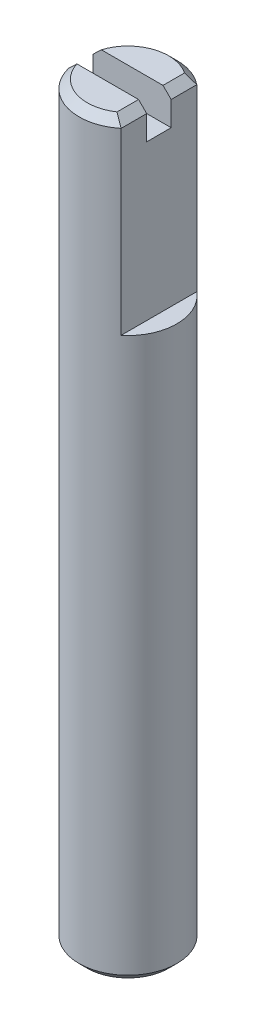
ISO-10303-21;
HEADER;
FILE_DESCRIPTION(('STEP AP214'),'2;1');
FILE_NAME('part.step','',(''),(''),'','','');
FILE_SCHEMA(('AUTOMOTIVE_DESIGN { 1 0 10303 214 1 1 1 1 }'));
ENDSEC;
DATA;
#1=APPLICATION_CONTEXT('core data for automotive mechanical design processes');
#2=APPLICATION_PROTOCOL_DEFINITION('international standard','automotive_design',2000,#1);
#3=PRODUCT_CONTEXT('',#1,'mechanical');
#4=PRODUCT('Part','Part','',(#3));
#5=PRODUCT_RELATED_PRODUCT_CATEGORY('part','',(#4));
#6=PRODUCT_DEFINITION_FORMATION('','',#4);
#7=PRODUCT_DEFINITION_CONTEXT('part definition',#1,'design');
#8=PRODUCT_DEFINITION('design','',#6,#7);
#9=PRODUCT_DEFINITION_SHAPE('','',#8);
#10=(LENGTH_UNIT() NAMED_UNIT(*) SI_UNIT(.MILLI.,.METRE.));
#11=(NAMED_UNIT(*) PLANE_ANGLE_UNIT() SI_UNIT($,.RADIAN.));
#12=(NAMED_UNIT(*) SI_UNIT($,.STERADIAN.) SOLID_ANGLE_UNIT());
#13=UNCERTAINTY_MEASURE_WITH_UNIT(LENGTH_MEASURE(1.E-05),#10,'distance_accuracy_value','');
#14=(GEOMETRIC_REPRESENTATION_CONTEXT(3) GLOBAL_UNCERTAINTY_ASSIGNED_CONTEXT((#13)) GLOBAL_UNIT_ASSIGNED_CONTEXT((#10,
#11,#12)) REPRESENTATION_CONTEXT('',''));
#15=CARTESIAN_POINT('',(0.,0.,0.));
#16=DIRECTION('',(0.,0.,1.));
#17=DIRECTION('',(1.,0.,0.));
#18=AXIS2_PLACEMENT_3D('',#15,#16,#17);
#19=CARTESIAN_POINT('',(0.,46.,0.));
#20=DIRECTION('',(0.,1.,0.));
#21=DIRECTION('',(0.,0.,1.));
#22=AXIS2_PLACEMENT_3D('',#19,#20,#21);
#23=PLANE('',#22);
#24=DIRECTION('',(-1.,0.,0.));
#25=VECTOR('',#24,1.);
#26=CARTESIAN_POINT('',(-4.20448110963809,46.,-0.75));
#27=LINE('',#26,#25);
#28=CARTESIAN_POINT('',(1.4,46.,-0.75));
#29=VERTEX_POINT('',#28);
#30=CARTESIAN_POINT('',(-2.38484800354237,46.,-0.75));
#31=VERTEX_POINT('',#30);
#32=EDGE_CURVE('E117',#29,#31,#27,.T.);
#33=ORIENTED_EDGE('',*,*,#32,.F.);
#34=DIRECTION('',(0.,0.,-1.));
#35=VECTOR('',#34,1.);
#36=CARTESIAN_POINT('',(1.4,46.,-2.32163735324878));
#37=LINE('',#36,#35);
#38=CARTESIAN_POINT('',(1.4,46.,-2.0712315177208));
#39=VERTEX_POINT('',#38);
#40=EDGE_CURVE('E127',#29,#39,#37,.T.);
#41=ORIENTED_EDGE('',*,*,#40,.T.);
#42=CARTESIAN_POINT('',(0.,46.,0.));
#43=DIRECTION('',(0.,1.,0.));
#44=DIRECTION('',(0.,0.,1.));
#45=AXIS2_PLACEMENT_3D('',#42,#43,#44);
#46=CIRCLE('',#45,2.5);
#47=EDGE_CURVE('E123',#39,#31,#46,.T.);
#48=ORIENTED_EDGE('',*,*,#47,.T.);
#49=EDGE_LOOP('',(#33,#41,#48));
#50=FACE_BOUND('',#49,.T.);
#51=ADVANCED_FACE('F36',(#50),#23,.T.);
#52=CARTESIAN_POINT('',(0.,46.,0.));
#53=DIRECTION('',(0.,-1.,0.));
#54=DIRECTION('',(0.,0.,-1.));
#55=AXIS2_PLACEMENT_3D('',#52,#53,#54);
#56=CONICAL_SURFACE('',#55,2.5,0.785398163397446);
#57=CARTESIAN_POINT('',(4.85546648544594,43.5869505608748,-0.75));
#58=CARTESIAN_POINT('',(4.71391751814024,43.7268339179038,-0.75));
#59=CARTESIAN_POINT('',(4.57230358961933,43.8666516445853,-0.75));
#60=CARTESIAN_POINT('',(4.28880108237509,44.1461810613772,-0.75));
#61=CARTESIAN_POINT('',(4.14691238893823,44.2858926351272,-0.75));
#62=CARTESIAN_POINT('',(3.86127263974073,44.5666520980558,-0.75));
#63=CARTESIAN_POINT('',(3.71751875661088,44.7076971132396,-0.75));
#64=CARTESIAN_POINT('',(3.42974051573235,44.9893367037925,-0.75));
#65=CARTESIAN_POINT('',(3.28571637369892,45.1299314997118,-0.75));
#66=CARTESIAN_POINT('',(2.93989103598639,45.4663218282814,-0.75));
#67=CARTESIAN_POINT('',(2.73785155133891,45.6618733471203,-0.75));
#68=CARTESIAN_POINT('',(2.43320769576117,45.9539852679423,-0.75));
#69=CARTESIAN_POINT('',(2.33128569885287,46.0512568065885,-0.75));
#70=CARTESIAN_POINT('',(2.12679744855882,46.2450738434784,-0.75));
#71=CARTESIAN_POINT('',(2.02423135234748,46.3416195071128,-0.75));
#72=CARTESIAN_POINT('',(1.81902178806528,46.5327781653922,-0.75));
#73=CARTESIAN_POINT('',(1.7163872378001,46.6274007248914,-0.75));
#74=CARTESIAN_POINT('',(1.50947924967405,46.8150418941384,-0.75));
#75=CARTESIAN_POINT('',(1.40520442567092,46.9080589906662,-0.75));
#76=CARTESIAN_POINT('',(1.24697987681958,47.0450828543339,-0.75));
#77=CARTESIAN_POINT('',(1.19404151140738,47.090254667941,-0.75));
#78=CARTESIAN_POINT('',(1.08724510724501,47.1794946775113,-0.75));
#79=CARTESIAN_POINT('',(1.03338715456041,47.2235629758124,-0.75));
#80=CARTESIAN_POINT('',(0.92446536873339,47.3100253586608,-0.75));
#81=CARTESIAN_POINT('',(0.869403377208695,47.3524217552695,-0.75));
#82=CARTESIAN_POINT('',(0.757461961467523,47.4347314734575,-0.75));
#83=CARTESIAN_POINT('',(0.700583630230699,47.4746462472666,-0.75));
#84=CARTESIAN_POINT('',(0.627950659447265,47.5218870208621,-0.75));
#85=CARTESIAN_POINT('',(0.613448673839788,47.5311399395592,-0.75));
#86=CARTESIAN_POINT('',(0.584259867977792,47.5493534183932,-0.75));
#87=CARTESIAN_POINT('',(0.56957302486066,47.5583139418653,-0.75));
#88=CARTESIAN_POINT('',(0.525209815191698,47.584697350443,-0.75));
#89=CARTESIAN_POINT('',(0.495232542840808,47.601620906839,-0.75));
#90=CARTESIAN_POINT('',(0.434575158801095,47.6335724992165,-0.75));
#91=CARTESIAN_POINT('',(0.403902488412216,47.6486144784893,-0.75));
#92=CARTESIAN_POINT('',(0.341525886813764,47.6763740420576,-0.75));
#93=CARTESIAN_POINT('',(0.309822292485401,47.6890923768492,-0.75));
#94=CARTESIAN_POINT('',(0.233817168557133,47.7154671874918,-0.75));
#95=CARTESIAN_POINT('',(0.189048524095931,47.7278459632544,-0.75));
#96=CARTESIAN_POINT('',(0.0981565745366103,47.7449059854211,-0.75));
#97=CARTESIAN_POINT('',(0.0520389613173522,47.7496158440244,-0.75));
#98=CARTESIAN_POINT('',(-0.0404571223636343,47.750339451112,-0.75));
#99=CARTESIAN_POINT('',(-0.0868358956972547,47.7463181258543,-0.75));
#100=CARTESIAN_POINT('',(-0.178298341126961,47.7304300811928,-0.75));
#101=CARTESIAN_POINT('',(-0.223377161429271,47.7185371603029,-0.75));
#102=CARTESIAN_POINT('',(-0.314423603805141,47.6879695597888,-0.75));
#103=CARTESIAN_POINT('',(-0.360251724417719,47.6688972445175,-0.75));
#104=CARTESIAN_POINT('',(-0.449840775637533,47.6263300876817,-0.75));
#105=CARTESIAN_POINT('',(-0.493597612467751,47.6028269108554,-0.75));
#106=CARTESIAN_POINT('',(-0.579732918556699,47.5527115468484,-0.75));
#107=CARTESIAN_POINT('',(-0.622097496569792,47.5260759078861,-0.75));
#108=CARTESIAN_POINT('',(-0.705449000112637,47.4708315616801,-0.75));
#109=CARTESIAN_POINT('',(-0.74643712127383,47.4422246363411,-0.75));
#110=CARTESIAN_POINT('',(-0.831072229251538,47.3809590503304,-0.75));
#111=CARTESIAN_POINT('',(-0.874622926775298,47.3481682938371,-0.75));
#112=CARTESIAN_POINT('',(-0.960822536400224,47.2814182298283,-0.75));
#113=CARTESIAN_POINT('',(-1.00347132752926,47.24745876714,-0.75));
#114=CARTESIAN_POINT('',(-1.13043861769896,47.1442974143724,-0.75));
#115=CARTESIAN_POINT('',(-1.21373668759201,47.0738435287605,-0.75));
#116=CARTESIAN_POINT('',(-1.37882945788233,46.9309270443904,-0.75));
#117=CARTESIAN_POINT('',(-1.46062122307301,46.8584610979528,-0.75));
#118=CARTESIAN_POINT('',(-1.62310045342943,46.7123495844164,-0.75));
#119=CARTESIAN_POINT('',(-1.70378822539481,46.6387043579155,-0.75));
#120=CARTESIAN_POINT('',(-1.86416074739795,46.490861579326,-0.75));
#121=CARTESIAN_POINT('',(-1.94384793209381,46.4166666593713,-0.75));
#122=CARTESIAN_POINT('',(-2.1027035826176,46.2677129725153,-0.75));
#123=CARTESIAN_POINT('',(-2.18187201115016,46.1929541658874,-0.75));
#124=CARTESIAN_POINT('',(-2.41864694962691,45.968230811901,-0.75));
#125=CARTESIAN_POINT('',(-2.57568545292842,45.8176683462495,-0.75));
#126=CARTESIAN_POINT('',(-2.86586604270801,45.5378268042253,-0.75));
#127=CARTESIAN_POINT('',(-2.99912819937921,45.4086718083781,-0.75));
#128=CARTESIAN_POINT('',(-3.26521025306288,45.1499047273037,-0.75));
#129=CARTESIAN_POINT('',(-3.39803014618622,45.0202926380775,-0.75));
#130=CARTESIAN_POINT('',(-3.79613359583078,44.6308842912431,-0.75));
#131=CARTESIAN_POINT('',(-4.06095635023667,44.3706172796803,-0.75));
#132=CARTESIAN_POINT('',(-4.58978064471943,43.8495620771406,-0.75));
#133=CARTESIAN_POINT('',(-4.8537825762484,43.5887742828285,-0.75));
#134=CARTESIAN_POINT('',(-5.38124093951394,43.0668694648215,-0.75));
#135=CARTESIAN_POINT('',(-5.64469755416627,42.8057526260434,-0.75));
#136=CARTESIAN_POINT('',(-5.90805222211768,42.5445335145541,-0.75));
#137=B_SPLINE_CURVE_WITH_KNOTS('',3,(#57,#58,#59,#60,#61,#62,#63,#64,#65,#66,#67,#68,#69,#70,
#71,#72,#73,#74,#75,#76,#77,#78,#79,#80,#81,#82,#83,#84,#85,#86,#87,#88,#89,#90,#91,#92,#93,#94,
#95,#96,#97,#98,#99,#100,#101,#102,#103,#104,#105,#106,#107,#108,#109,#110,#111,#112,#113,#114,
#115,#116,#117,#118,#119,#120,#121,#122,#123,#124,#125,#126,#127,#128,#129,#130,#131,#132,#133,
#134,#135,#136),.UNSPECIFIED.,.F.,.F.,(4,2,2,2,2,2,2,2,2,2,2,2,2,2,2,2,2,2,2,2,2,2,2,2,2,2,2,2,
2,2,2,2,2,2,2,2,2,2,2,4),(0.,0.597018640220917,1.19440070987918,1.79857709732601,
2.40238869166986,3.24591029076411,3.66857683630106,4.09114396635307,4.50992701708793,
4.92908532496539,5.13785016972322,5.34659558181231,5.55504140225114,5.7633640705378,
5.81496833806888,5.86657905182656,5.96980684555416,6.0722175620409,6.17459514297382,
6.31341671385353,6.45171915432519,6.59057819238501,6.72990177852883,6.87847008513261,
7.0273207163603,7.17736672356993,7.32727883518822,7.49079613313603,7.6543352262002,
7.98156825423644,8.30938290016302,8.63710451631824,8.96374229694019,9.29040330867593,
9.94306027188856,10.4997984074273,11.0565414258687,12.1704642859962,13.2837318558053,
14.3965305597468),.UNSPECIFIED.);
#138=CARTESIAN_POINT('',(-2.90473750965556,45.5,-0.75));
#139=VERTEX_POINT('',#138);
#140=EDGE_CURVE('E205',#31,#139,#137,.T.);
#141=ORIENTED_EDGE('',*,*,#140,.F.);
#142=ORIENTED_EDGE('',*,*,#47,.F.);
#143=CARTESIAN_POINT('',(1.4,46.,-2.0712315177208));
#144=CARTESIAN_POINT('',(1.4413852135024,45.9586147864976,-2.09320945461325));
#145=CARTESIAN_POINT('',(1.48285098512596,45.917149014874,-2.11488261625374));
#146=CARTESIAN_POINT('',(1.56592540981716,45.8340745901828,-2.15765950140076));
#147=CARTESIAN_POINT('',(1.60753405112698,45.792465948873,-2.17876327055802));
#148=CARTESIAN_POINT('',(1.69088190476341,45.7091180952366,-2.22044463609142));
#149=CARTESIAN_POINT('',(1.73262111476999,45.66737888523,-2.24102224175779));
#150=CARTESIAN_POINT('',(1.81622229209506,45.5837777079049,-2.28168833918956));
#151=CARTESIAN_POINT('',(1.85808426901179,45.5419157309882,-2.30177679150407));
#152=CARTESIAN_POINT('',(1.9,45.5,-2.32163735324878));
#153=B_SPLINE_CURVE_WITH_KNOTS('',3,(#143,#144,#145,#146,#147,#148,#149,#150,#151,#152),
.UNSPECIFIED.,.F.,.F.,(4,2,2,2,4),(0.,0.187552478291846,0.375089874712568,0.562623957579342,
0.750173115565102),.UNSPECIFIED.);
#154=CARTESIAN_POINT('',(1.9,45.5,-2.32163735324878));
#155=VERTEX_POINT('',#154);
#156=EDGE_CURVE('E149',#155,#39,#153,.F.);
#157=ORIENTED_EDGE('',*,*,#156,.F.);
#158=CARTESIAN_POINT('',(0.,45.5,0.));
#159=DIRECTION('',(0.,1.,0.));
#160=DIRECTION('',(0.,0.,1.));
#161=AXIS2_PLACEMENT_3D('',#158,#159,#160);
#162=CIRCLE('',#161,3.);
#163=EDGE_CURVE('E137',#139,#155,#162,.F.);
#164=ORIENTED_EDGE('',*,*,#163,.F.);
#165=EDGE_LOOP('',(#141,#142,#157,#164));
#166=FACE_BOUND('',#165,.T.);
#167=ADVANCED_FACE('F170',(#166),#56,.T.);
#168=CARTESIAN_POINT('',(1.9,45.5,-3.80448227912211));
#169=DIRECTION('',(0.707106781186549,0.707106781186546,0.));
#170=DIRECTION('',(-0.707106781186546,0.707106781186549,0.));
#171=AXIS2_PLACEMENT_3D('',#168,#169,#170);
#172=PLANE('',#171);
#173=DIRECTION('',(-0.707106781186546,0.707106781186549,0.));
#174=VECTOR('',#173,1.);
#175=CARTESIAN_POINT('',(1.9,45.5,-0.75));
#176=LINE('',#175,#174);
#177=CARTESIAN_POINT('',(1.9,45.5,-0.75));
#178=VERTEX_POINT('',#177);
#179=EDGE_CURVE('E44',#178,#29,#176,.T.);
#180=ORIENTED_EDGE('',*,*,#179,.F.);
#181=DIRECTION('',(0.,0.,1.));
#182=VECTOR('',#181,1.);
#183=CARTESIAN_POINT('',(1.9,45.5,2.32163735324878));
#184=LINE('',#183,#182);
#185=EDGE_CURVE('E124',#155,#178,#184,.T.);
#186=ORIENTED_EDGE('',*,*,#185,.F.);
#187=ORIENTED_EDGE('',*,*,#156,.T.);
#188=ORIENTED_EDGE('',*,*,#40,.F.);
#189=EDGE_LOOP('',(#180,#186,#187,#188));
#190=FACE_BOUND('',#189,.T.);
#191=ADVANCED_FACE('F161',(#190),#172,.T.);
#192=CARTESIAN_POINT('',(0.,46.,0.));
#193=DIRECTION('',(0.,-1.,0.));
#194=DIRECTION('',(0.,0.,-1.));
#195=AXIS2_PLACEMENT_3D('',#192,#193,#194);
#196=CYLINDRICAL_SURFACE('',#195,3.);
#197=CARTESIAN_POINT('',(0.,0.499999999999987,0.));
#198=DIRECTION('',(0.,1.,0.));
#199=DIRECTION('',(0.,0.,1.));
#200=AXIS2_PLACEMENT_3D('',#197,#198,#199);
#201=CIRCLE('',#200,3.);
#202=CARTESIAN_POINT('',(0.,0.499999999999987,3.));
#203=VERTEX_POINT('',#202);
#204=EDGE_CURVE('E134',#203,#203,#201,.T.);
#205=ORIENTED_EDGE('',*,*,#204,.T.);
#206=EDGE_LOOP('',(#205));
#207=FACE_BOUND('',#206,.T.);
#208=CARTESIAN_POINT('',(0.,44.,0.));
#209=DIRECTION('',(0.,1.,0.));
#210=DIRECTION('',(0.,0.,1.));
#211=AXIS2_PLACEMENT_3D('',#208,#209,#210);
#212=CIRCLE('',#211,3.);
#213=CARTESIAN_POINT('',(-2.90473750965556,44.,-0.75));
#214=VERTEX_POINT('',#213);
#215=CARTESIAN_POINT('',(-2.90473750965556,44.,0.75));
#216=VERTEX_POINT('',#215);
#217=EDGE_CURVE('E150',#214,#216,#212,.T.);
#218=ORIENTED_EDGE('',*,*,#217,.F.);
#219=DIRECTION('',(0.,-1.,0.));
#220=VECTOR('',#219,1.);
#221=CARTESIAN_POINT('',(-2.90473750965556,46.,-0.75));
#222=LINE('',#221,#220);
#223=EDGE_CURVE('E199',#214,#139,#222,.F.);
#224=ORIENTED_EDGE('',*,*,#223,.T.);
#225=ORIENTED_EDGE('',*,*,#163,.T.);
#226=DIRECTION('',(0.,-1.,0.));
#227=VECTOR('',#226,1.);
#228=CARTESIAN_POINT('',(1.9,46.,-2.32163735324878));
#229=LINE('',#228,#227);
#230=CARTESIAN_POINT('',(1.9,34.5,-2.32163735324878));
#231=VERTEX_POINT('',#230);
#232=EDGE_CURVE('E215',#155,#231,#229,.T.);
#233=ORIENTED_EDGE('',*,*,#232,.T.);
#234=CARTESIAN_POINT('',(0.,34.5,0.));
#235=DIRECTION('',(0.,1.,0.));
#236=DIRECTION('',(0.,0.,1.));
#237=AXIS2_PLACEMENT_3D('',#234,#235,#236);
#238=CIRCLE('',#237,3.);
#239=CARTESIAN_POINT('',(1.9,34.5,2.32163735324878));
#240=VERTEX_POINT('',#239);
#241=EDGE_CURVE('E216',#240,#231,#238,.T.);
#242=ORIENTED_EDGE('',*,*,#241,.F.);
#243=DIRECTION('',(0.,-1.,0.));
#244=VECTOR('',#243,1.);
#245=CARTESIAN_POINT('',(1.9,46.,2.32163735324878));
#246=LINE('',#245,#244);
#247=CARTESIAN_POINT('',(1.9,45.5,2.32163735324878));
#248=VERTEX_POINT('',#247);
#249=EDGE_CURVE('E212',#240,#248,#246,.F.);
#250=ORIENTED_EDGE('',*,*,#249,.T.);
#251=CARTESIAN_POINT('',(-2.90473750965556,45.5,0.75));
#252=VERTEX_POINT('',#251);
#253=EDGE_CURVE('E138',#248,#252,#162,.F.);
#254=ORIENTED_EDGE('',*,*,#253,.T.);
#255=DIRECTION('',(0.,-1.,0.));
#256=VECTOR('',#255,1.);
#257=CARTESIAN_POINT('',(-2.90473750965556,46.,0.75));
#258=LINE('',#257,#256);
#259=EDGE_CURVE('E109',#252,#216,#258,.T.);
#260=ORIENTED_EDGE('',*,*,#259,.T.);
#261=EDGE_LOOP('',(#218,#224,#225,#233,#242,#250,#254,#260));
#262=FACE_BOUND('',#261,.T.);
#263=ADVANCED_FACE('F172',(#207,#262),#196,.T.);
#264=DIRECTION('',(1.,0.,0.));
#265=VECTOR('',#264,1.);
#266=CARTESIAN_POINT('',(0.750000000000001,46.,0.75));
#267=LINE('',#266,#265);
#268=CARTESIAN_POINT('',(-2.38484800354237,46.,0.75));
#269=VERTEX_POINT('',#268);
#270=CARTESIAN_POINT('',(1.4,46.,0.750000000000001));
#271=VERTEX_POINT('',#270);
#272=EDGE_CURVE('E51',#269,#271,#267,.T.);
#273=ORIENTED_EDGE('',*,*,#272,.F.);
#274=CARTESIAN_POINT('',(1.4,46.,2.0712315177208));
#275=VERTEX_POINT('',#274);
#276=EDGE_CURVE('E58',#269,#275,#46,.T.);
#277=ORIENTED_EDGE('',*,*,#276,.T.);
#278=EDGE_CURVE('E116',#275,#271,#37,.T.);
#279=ORIENTED_EDGE('',*,*,#278,.T.);
#280=EDGE_LOOP('',(#273,#277,#279));
#281=FACE_BOUND('',#280,.T.);
#282=ADVANCED_FACE('F115',(#281),#23,.T.);
#283=CARTESIAN_POINT('',(0.,0.,0.));
#284=DIRECTION('',(0.,1.,0.));
#285=DIRECTION('',(0.,0.,1.));
#286=AXIS2_PLACEMENT_3D('',#283,#284,#285);
#287=PLANE('',#286);
#288=CARTESIAN_POINT('',(0.,0.,0.));
#289=DIRECTION('',(0.,1.,0.));
#290=DIRECTION('',(0.,0.,1.));
#291=AXIS2_PLACEMENT_3D('',#288,#289,#290);
#292=CIRCLE('',#291,2.50000000000001);
#293=CARTESIAN_POINT('',(0.,0.,2.50000000000001));
#294=VERTEX_POINT('',#293);
#295=EDGE_CURVE('E140',#294,#294,#292,.F.);
#296=ORIENTED_EDGE('',*,*,#295,.T.);
#297=EDGE_LOOP('',(#296));
#298=FACE_BOUND('',#297,.T.);
#299=ADVANCED_FACE('F185',(#298),#287,.F.);
#300=CARTESIAN_POINT('',(1.9,34.5,4.94695527819999));
#301=DIRECTION('',(0.,1.,0.));
#302=DIRECTION('',(0.,0.,1.));
#303=AXIS2_PLACEMENT_3D('',#300,#301,#302);
#304=PLANE('',#303);
#305=ORIENTED_EDGE('',*,*,#241,.T.);
#306=DIRECTION('',(0.,0.,1.));
#307=VECTOR('',#306,1.);
#308=CARTESIAN_POINT('',(1.9,34.5,-3.80448227912211));
#309=LINE('',#308,#307);
#310=EDGE_CURVE('E209',#231,#240,#309,.T.);
#311=ORIENTED_EDGE('',*,*,#310,.T.);
#312=EDGE_LOOP('',(#305,#311));
#313=FACE_BOUND('',#312,.T.);
#314=ADVANCED_FACE('F190',(#313),#304,.T.);
#315=CARTESIAN_POINT('',(1.9,34.5,-3.80448227912211));
#316=DIRECTION('',(-1.,0.,0.));
#317=DIRECTION('',(0.,0.,1.));
#318=AXIS2_PLACEMENT_3D('',#315,#316,#317);
#319=PLANE('',#318);
#320=ORIENTED_EDGE('',*,*,#185,.T.);
#321=DIRECTION('',(0.,-1.,0.));
#322=VECTOR('',#321,1.);
#323=CARTESIAN_POINT('',(1.9,34.5,-0.75));
#324=LINE('',#323,#322);
#325=CARTESIAN_POINT('',(1.9,44.,-0.75));
#326=VERTEX_POINT('',#325);
#327=EDGE_CURVE('E240',#178,#326,#324,.T.);
#328=ORIENTED_EDGE('',*,*,#327,.T.);
#329=DIRECTION('',(0.,0.,-1.));
#330=VECTOR('',#329,1.);
#331=CARTESIAN_POINT('',(1.9,44.,-3.80448227912211));
#332=LINE('',#331,#330);
#333=CARTESIAN_POINT('',(1.9,44.,0.75));
#334=VERTEX_POINT('',#333);
#335=EDGE_CURVE('E11',#334,#326,#332,.T.);
#336=ORIENTED_EDGE('',*,*,#335,.F.);
#337=DIRECTION('',(0.,1.,0.));
#338=VECTOR('',#337,1.);
#339=CARTESIAN_POINT('',(1.9,34.5,0.75));
#340=LINE('',#339,#338);
#341=CARTESIAN_POINT('',(1.9,45.5,0.75));
#342=VERTEX_POINT('',#341);
#343=EDGE_CURVE('E113',#334,#342,#340,.T.);
#344=ORIENTED_EDGE('',*,*,#343,.T.);
#345=EDGE_CURVE('E129',#342,#248,#184,.T.);
#346=ORIENTED_EDGE('',*,*,#345,.T.);
#347=ORIENTED_EDGE('',*,*,#249,.F.);
#348=ORIENTED_EDGE('',*,*,#310,.F.);
#349=ORIENTED_EDGE('',*,*,#232,.F.);
#350=EDGE_LOOP('',(#320,#328,#336,#344,#346,#347,#348,#349));
#351=FACE_BOUND('',#350,.T.);
#352=ADVANCED_FACE('F169',(#351),#319,.F.);
#353=CARTESIAN_POINT('',(-5.90805222211768,42.5445335145541,0.75));
#354=CARTESIAN_POINT('',(-5.7300437395593,42.7211182797016,0.75));
#355=CARTESIAN_POINT('',(-5.5519781811539,42.8976455826347,0.75));
#356=CARTESIAN_POINT('',(-5.19562698595573,43.2505795944583,0.75));
#357=CARTESIAN_POINT('',(-5.01734130087648,43.4269862545898,0.75));
#358=CARTESIAN_POINT('',(-4.65953925429748,43.7805667968283,0.75));
#359=CARTESIAN_POINT('',(-4.4800216229419,43.9577393947003,0.75));
#360=CARTESIAN_POINT('',(-4.1207115762482,44.3117044062391,0.75));
#361=CARTESIAN_POINT('',(-3.94091925245865,44.4884969128669,0.75));
#362=CARTESIAN_POINT('',(-3.52463057261854,44.8967619641763,0.75));
#363=CARTESIAN_POINT('',(-3.28796588246162,45.1280633122341,0.75));
#364=CARTESIAN_POINT('',(-2.93173781752874,45.4739787964349,0.75));
#365=CARTESIAN_POINT('',(-2.81273196769819,45.5891667899296,0.75));
#366=CARTESIAN_POINT('',(-2.57419111944658,45.8189694466708,0.75));
#367=CARTESIAN_POINT('',(-2.45465617783918,45.9335841687885,0.75));
#368=CARTESIAN_POINT('',(-2.21530021118799,46.1614700985172,0.75));
#369=CARTESIAN_POINT('',(-2.0954826861627,46.2747449799585,0.75));
#370=CARTESIAN_POINT('',(-1.85454534965147,46.5000069277706,0.75));
#371=CARTESIAN_POINT('',(-1.7334250379864,46.6119934626787,0.75));
#372=CARTESIAN_POINT('',(-1.55021670981294,46.7780753151848,0.75));
#373=CARTESIAN_POINT('',(-1.48894715115251,46.8330720946584,0.75));
#374=CARTESIAN_POINT('',(-1.36565727342003,46.9422160700248,0.75));
#375=CARTESIAN_POINT('',(-1.30363698506068,46.9963633004663,0.75));
#376=CARTESIAN_POINT('',(-1.17858166104869,47.1033937084682,0.75));
#377=CARTESIAN_POINT('',(-1.11554730183056,47.1562776745826,0.75));
#378=CARTESIAN_POINT('',(-0.987957723082008,47.260171785908,0.75));
#379=CARTESIAN_POINT('',(-0.923402903655158,47.3111824152351,0.75));
#380=CARTESIAN_POINT('',(-0.837168345255993,47.3760904646723,0.75));
#381=CARTESIAN_POINT('',(-0.816538896509228,47.3913821651796,0.75));
#382=CARTESIAN_POINT('',(-0.775013631589498,47.4216017291049,0.75));
#383=CARTESIAN_POINT('',(-0.754117799148224,47.4365295701379,0.75));
#384=CARTESIAN_POINT('',(-0.690951805021064,47.4806851123899,0.75));
#385=CARTESIAN_POINT('',(-0.648224577913421,47.509268505437,0.75));
#386=CARTESIAN_POINT('',(-0.561600823562836,47.5636410896857,0.75));
#387=CARTESIAN_POINT('',(-0.517720246026501,47.5894553469718,0.75));
#388=CARTESIAN_POINT('',(-0.427969032507345,47.6373192838869,0.75));
#389=CARTESIAN_POINT('',(-0.382100935440808,47.6593735985522,0.75));
#390=CARTESIAN_POINT('',(-0.289139389490887,47.6972876205326,0.75));
#391=CARTESIAN_POINT('',(-0.242106331203806,47.7132899768874,0.75));
#392=CARTESIAN_POINT('',(-0.146147768547643,47.7372776002484,0.75));
#393=CARTESIAN_POINT('',(-0.0972336293325455,47.7453049543675,0.75));
#394=CARTESIAN_POINT('',(-0.0231864319626151,47.7500585271591,0.75));
#395=CARTESIAN_POINT('',(0.00174021004875388,47.7504109330291,0.75));
#396=CARTESIAN_POINT('',(0.0515048178641391,47.7486443534627,0.75));
#397=CARTESIAN_POINT('',(0.0763427829173864,47.7465253471521,0.75));
#398=CARTESIAN_POINT('',(0.150532486968317,47.736609846358,0.75));
#399=CARTESIAN_POINT('',(0.199425670405804,47.7252472831875,0.75));
#400=CARTESIAN_POINT('',(0.283280211488023,47.6990318217914,0.75));
#401=CARTESIAN_POINT('',(0.318752990991716,47.6856859693322,0.75));
#402=CARTESIAN_POINT('',(0.388429961633229,47.6559691533283,0.75));
#403=CARTESIAN_POINT('',(0.422633138445516,47.6395958309535,0.75));
#404=CARTESIAN_POINT('',(0.490028249367692,47.6045708122788,0.75));
#405=CARTESIAN_POINT('',(0.523214861788839,47.5859090683174,0.75));
#406=CARTESIAN_POINT('',(0.588599610908543,47.5469724534713,0.75));
#407=CARTESIAN_POINT('',(0.620798160111266,47.5266982688161,0.75));
#408=CARTESIAN_POINT('',(0.690544369206184,47.4809169359261,0.75));
#409=CARTESIAN_POINT('',(0.727923975932828,47.455155410087,0.75));
#410=CARTESIAN_POINT('',(0.801805936963717,47.4023988829232,0.75));
#411=CARTESIAN_POINT('',(0.838308117829014,47.3754036407425,0.75));
#412=CARTESIAN_POINT('',(0.946840298422189,47.2930352944314,0.75));
#413=CARTESIAN_POINT('',(1.01784429760509,47.2363148657792,0.75));
#414=CARTESIAN_POINT('',(1.15829144744998,47.1206628329758,0.75));
#415=CARTESIAN_POINT('',(1.22773037131685,47.061726175715,0.75));
#416=CARTESIAN_POINT('',(1.36541918193637,46.9425394229377,0.75));
#417=CARTESIAN_POINT('',(1.43366954370287,46.8822898748534,0.75));
#418=CARTESIAN_POINT('',(1.56956422312961,46.7607154767464,0.75));
#419=CARTESIAN_POINT('',(1.63720616737366,46.6993879848798,0.75));
#420=CARTESIAN_POINT('',(1.77191103420654,46.5760878717136,0.75));
#421=CARTESIAN_POINT('',(1.83897389770677,46.5141151859698,0.75));
#422=CARTESIAN_POINT('',(2.03932416042386,46.3276912815607,0.75));
#423=CARTESIAN_POINT('',(2.17197238810376,46.2025539425657,0.75));
#424=CARTESIAN_POINT('',(2.41240962976595,45.9739108837483,0.75));
#425=CARTESIAN_POINT('',(2.52036373335978,45.8705779549053,0.75));
#426=CARTESIAN_POINT('',(2.7357971345809,45.6634155440413,0.75));
#427=CARTESIAN_POINT('',(2.84327642614307,45.5595860557125,0.75));
#428=CARTESIAN_POINT('',(3.16533152506305,45.2474628467834,0.75));
#429=CARTESIAN_POINT('',(3.37940372913276,45.0386499826614,0.75));
#430=CARTESIAN_POINT('',(3.80412463678459,44.6228843071035,0.75));
#431=CARTESIAN_POINT('',(4.01478263102616,44.4159409665387,0.75));
#432=CARTESIAN_POINT('',(4.43548876894827,44.0016883458193,0.75));
#433=CARTESIAN_POINT('',(4.6455372036134,43.7943793612993,0.75));
#434=CARTESIAN_POINT('',(4.85546648544594,43.5869505608748,0.75));
#435=B_SPLINE_CURVE_WITH_KNOTS('',3,(#353,#354,#355,#356,#357,#358,#359,#360,#361,#362,#363,
#364,#365,#366,#367,#368,#369,#370,#371,#372,#373,#374,#375,#376,#377,#378,#379,#380,#381,#382,
#383,#384,#385,#386,#387,#388,#389,#390,#391,#392,#393,#394,#395,#396,#397,#398,#399,#400,#401,
#402,#403,#404,#405,#406,#407,#408,#409,#410,#411,#412,#413,#414,#415,#416,#417,#418,#419,#420,
#421,#422,#423,#424,#425,#426,#427,#428,#429,#430,#431,#432,#433,#434),.UNSPECIFIED.,.F.,.F.,(4,
2,2,2,2,2,2,2,2,2,2,2,2,2,2,2,2,2,2,2,2,2,2,2,2,2,2,2,2,2,2,2,2,2,2,2,2,2,2,2,4),(0.,
0.752211987196278,1.50463852943047,2.26130872152812,3.01776596840285,4.01053225491521,
4.50739736681278,5.00421036077185,5.49886459621984,5.99371605191733,6.24070792878019,
6.48768973501334,6.7345131133862,6.98127225115369,7.05830563449133,7.1353437450865,
7.2895007438732,7.4421173929317,7.59454452300597,7.74311397948915,7.89089514609984,
7.96556745017605,8.04024038496099,8.18998292366987,8.30353863450602,8.41718319710564,
8.53134591147411,8.64546029733427,8.78161595916709,8.91779831689761,9.19035042546889,
9.46356693171744,9.73667161676508,10.0105796952147,10.2845154002008,10.8315810074039,
11.2798944772936,11.7282136573395,12.6253536670476,13.5112542353314,14.3966209992728),.UNSPECIFIED.);
#436=EDGE_CURVE('E105',#252,#269,#435,.T.);
#437=ORIENTED_EDGE('',*,*,#436,.F.);
#438=ORIENTED_EDGE('',*,*,#253,.F.);
#439=CARTESIAN_POINT('',(1.9,45.5,2.32163735324878));
#440=CARTESIAN_POINT('',(1.85808426901179,45.5419157309882,2.30177679150407));
#441=CARTESIAN_POINT('',(1.81622229209505,45.5837777079049,2.28168833918956));
#442=CARTESIAN_POINT('',(1.73262111476999,45.66737888523,2.24102224175779));
#443=CARTESIAN_POINT('',(1.69088190476341,45.7091180952366,2.22044463609142));
#444=CARTESIAN_POINT('',(1.60753405112698,45.792465948873,2.17876327055802));
#445=CARTESIAN_POINT('',(1.56592540981716,45.8340745901828,2.15765950140076));
#446=CARTESIAN_POINT('',(1.48285098512596,45.917149014874,2.11488261625374));
#447=CARTESIAN_POINT('',(1.4413852135024,45.9586147864976,2.09320945461325));
#448=CARTESIAN_POINT('',(1.4,46.,2.0712315177208));
#449=B_SPLINE_CURVE_WITH_KNOTS('',3,(#439,#440,#441,#442,#443,#444,#445,#446,#447,#448),
.UNSPECIFIED.,.F.,.F.,(4,2,2,2,4),(0.,0.187549157985762,0.375083240852533,0.562620637273255,
0.750173115565101),.UNSPECIFIED.);
#450=EDGE_CURVE('E122',#275,#248,#449,.F.);
#451=ORIENTED_EDGE('',*,*,#450,.F.);
#452=ORIENTED_EDGE('',*,*,#276,.F.);
#453=EDGE_LOOP('',(#437,#438,#451,#452));
#454=FACE_BOUND('',#453,.T.);
#455=ADVANCED_FACE('F120',(#454),#56,.T.);
#456=DIRECTION('',(0.707106781186546,-0.707106781186549,0.));
#457=VECTOR('',#456,1.);
#458=CARTESIAN_POINT('',(1.9,45.5,0.75));
#459=LINE('',#458,#457);
#460=EDGE_CURVE('E143',#271,#342,#459,.T.);
#461=ORIENTED_EDGE('',*,*,#460,.F.);
#462=ORIENTED_EDGE('',*,*,#278,.F.);
#463=ORIENTED_EDGE('',*,*,#450,.T.);
#464=ORIENTED_EDGE('',*,*,#345,.F.);
#465=EDGE_LOOP('',(#461,#462,#463,#464));
#466=FACE_BOUND('',#465,.T.);
#467=ADVANCED_FACE('F157',(#466),#172,.T.);
#468=CARTESIAN_POINT('',(0.,0.499999999999987,0.));
#469=DIRECTION('',(0.,1.,0.));
#470=DIRECTION('',(0.,0.,1.));
#471=AXIS2_PLACEMENT_3D('',#468,#469,#470);
#472=CONICAL_SURFACE('',#471,3.,0.785398163397453);
#473=ORIENTED_EDGE('',*,*,#295,.F.);
#474=EDGE_LOOP('',(#473));
#475=FACE_BOUND('',#474,.T.);
#476=ORIENTED_EDGE('',*,*,#204,.F.);
#477=EDGE_LOOP('',(#476));
#478=FACE_BOUND('',#477,.T.);
#479=ADVANCED_FACE('F38',(#475,#478),#472,.T.);
#480=CARTESIAN_POINT('',(-4.20448110963809,44.,0.75));
#481=DIRECTION('',(0.,1.,0.));
#482=DIRECTION('',(0.,0.,1.));
#483=AXIS2_PLACEMENT_3D('',#480,#481,#482);
#484=PLANE('',#483);
#485=ORIENTED_EDGE('',*,*,#217,.T.);
#486=DIRECTION('',(1.,0.,0.));
#487=VECTOR('',#486,1.);
#488=CARTESIAN_POINT('',(-4.20448110963809,44.,0.75));
#489=LINE('',#488,#487);
#490=EDGE_CURVE('E235',#216,#334,#489,.T.);
#491=ORIENTED_EDGE('',*,*,#490,.T.);
#492=ORIENTED_EDGE('',*,*,#335,.T.);
#493=DIRECTION('',(-1.,0.,0.));
#494=VECTOR('',#493,1.);
#495=CARTESIAN_POINT('',(0.750000000000001,44.,-0.75));
#496=LINE('',#495,#494);
#497=EDGE_CURVE('E236',#326,#214,#496,.T.);
#498=ORIENTED_EDGE('',*,*,#497,.T.);
#499=EDGE_LOOP('',(#485,#491,#492,#498));
#500=FACE_BOUND('',#499,.T.);
#501=ADVANCED_FACE('F167',(#500),#484,.T.);
#502=CARTESIAN_POINT('',(-4.20448110963809,44.,-0.75));
#503=DIRECTION('',(0.,0.,-1.));
#504=DIRECTION('',(-1.,0.,0.));
#505=AXIS2_PLACEMENT_3D('',#502,#503,#504);
#506=PLANE('',#505);
#507=ORIENTED_EDGE('',*,*,#497,.F.);
#508=ORIENTED_EDGE('',*,*,#327,.F.);
#509=ORIENTED_EDGE('',*,*,#179,.T.);
#510=ORIENTED_EDGE('',*,*,#32,.T.);
#511=ORIENTED_EDGE('',*,*,#140,.T.);
#512=ORIENTED_EDGE('',*,*,#223,.F.);
#513=EDGE_LOOP('',(#507,#508,#509,#510,#511,#512));
#514=FACE_BOUND('',#513,.T.);
#515=ADVANCED_FACE('F247',(#514),#506,.F.);
#516=CARTESIAN_POINT('',(0.750000000000001,44.,0.75));
#517=DIRECTION('',(0.,0.,1.));
#518=DIRECTION('',(1.,0.,0.));
#519=AXIS2_PLACEMENT_3D('',#516,#517,#518);
#520=PLANE('',#519);
#521=ORIENTED_EDGE('',*,*,#436,.T.);
#522=ORIENTED_EDGE('',*,*,#272,.T.);
#523=ORIENTED_EDGE('',*,*,#460,.T.);
#524=ORIENTED_EDGE('',*,*,#343,.F.);
#525=ORIENTED_EDGE('',*,*,#490,.F.);
#526=ORIENTED_EDGE('',*,*,#259,.F.);
#527=EDGE_LOOP('',(#521,#522,#523,#524,#525,#526));
#528=FACE_BOUND('',#527,.T.);
#529=ADVANCED_FACE('F106',(#528),#520,.F.);
#530=CLOSED_SHELL('',(#51,#167,#191,#263,#282,#299,#314,#352,#455,#467,#479,#501,#515,#529));
#531=MANIFOLD_SOLID_BREP('B2',#530);
#532=ADVANCED_BREP_SHAPE_REPRESENTATION('',(#18,#531),#14);
#533=SHAPE_DEFINITION_REPRESENTATION(#9,#532);
ENDSEC;
END-ISO-10303-21;
